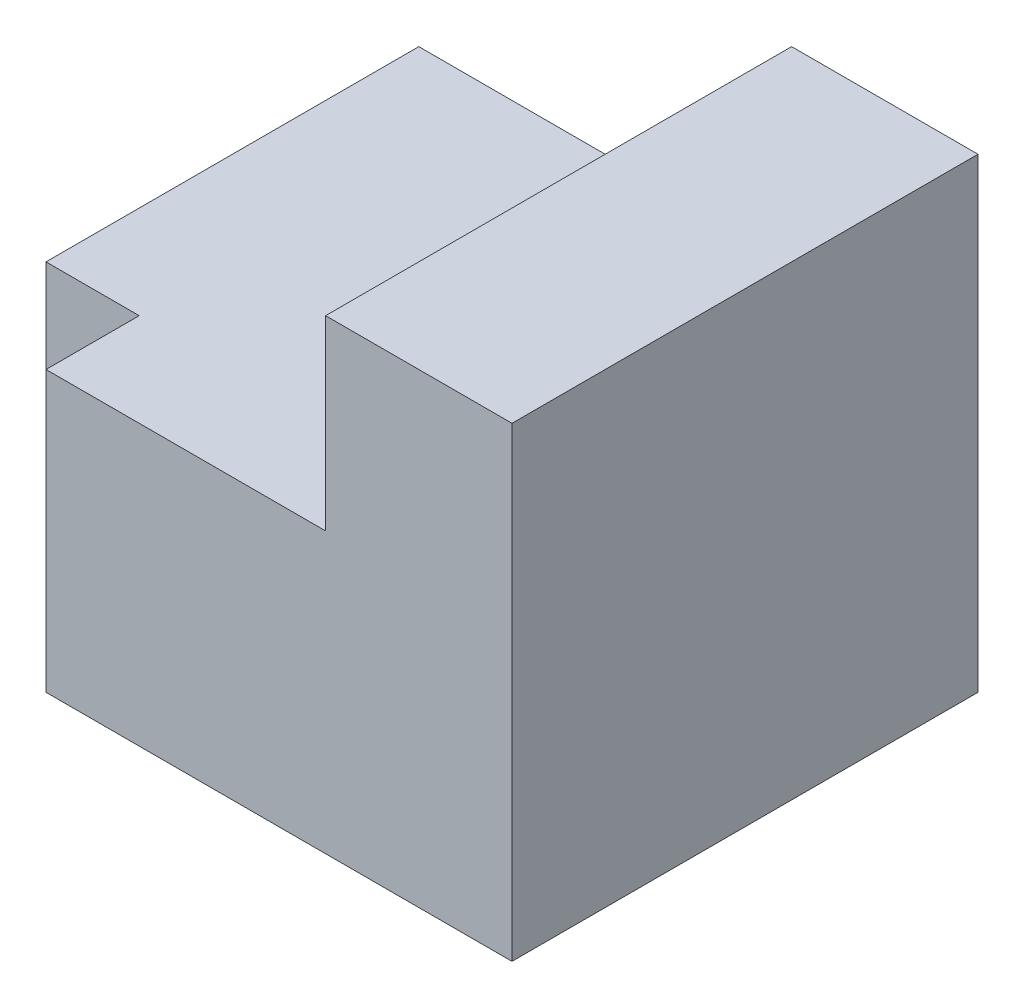
ISO-10303-21;
HEADER;
FILE_DESCRIPTION(('STEP AP214'),'2;1');
FILE_NAME('part.step','',(''),(''),'','','');
FILE_SCHEMA(('AUTOMOTIVE_DESIGN { 1 0 10303 214 1 1 1 1 }'));
ENDSEC;
DATA;
#1=APPLICATION_CONTEXT('core data for automotive mechanical design processes');
#2=APPLICATION_PROTOCOL_DEFINITION('international standard','automotive_design',2000,#1);
#3=PRODUCT_CONTEXT('',#1,'mechanical');
#4=PRODUCT('Part','Part','',(#3));
#5=PRODUCT_RELATED_PRODUCT_CATEGORY('part','',(#4));
#6=PRODUCT_DEFINITION_FORMATION('','',#4);
#7=PRODUCT_DEFINITION_CONTEXT('part definition',#1,'design');
#8=PRODUCT_DEFINITION('design','',#6,#7);
#9=PRODUCT_DEFINITION_SHAPE('','',#8);
#10=(LENGTH_UNIT() NAMED_UNIT(*) SI_UNIT(.MILLI.,.METRE.));
#11=(NAMED_UNIT(*) PLANE_ANGLE_UNIT() SI_UNIT($,.RADIAN.));
#12=(NAMED_UNIT(*) SI_UNIT($,.STERADIAN.) SOLID_ANGLE_UNIT());
#13=UNCERTAINTY_MEASURE_WITH_UNIT(LENGTH_MEASURE(1.E-05),#10,'distance_accuracy_value','');
#14=(GEOMETRIC_REPRESENTATION_CONTEXT(3) GLOBAL_UNCERTAINTY_ASSIGNED_CONTEXT((#13)) GLOBAL_UNIT_ASSIGNED_CONTEXT((#10,
#11,#12)) REPRESENTATION_CONTEXT('',''));
#15=CARTESIAN_POINT('',(0.,0.,0.));
#16=DIRECTION('',(0.,0.,1.));
#17=DIRECTION('',(1.,0.,0.));
#18=AXIS2_PLACEMENT_3D('',#15,#16,#17);
#19=CARTESIAN_POINT('',(0.,30.,50.));
#20=DIRECTION('',(0.,-1.,0.));
#21=DIRECTION('',(0.,0.,-1.));
#22=AXIS2_PLACEMENT_3D('',#19,#20,#21);
#23=PLANE('',#22);
#24=DIRECTION('',(1.,0.,0.));
#25=VECTOR('',#24,1.);
#26=CARTESIAN_POINT('',(20.,30.,30.));
#27=LINE('',#26,#25);
#28=CARTESIAN_POINT('',(20.,30.,30.));
#29=VERTEX_POINT('',#28);
#30=CARTESIAN_POINT('',(40.,30.,30.));
#31=VERTEX_POINT('',#30);
#32=EDGE_CURVE('E135',#29,#31,#27,.T.);
#33=ORIENTED_EDGE('',*,*,#32,.F.);
#34=DIRECTION('',(0.,0.,1.));
#35=VECTOR('',#34,1.);
#36=CARTESIAN_POINT('',(20.,30.,0.));
#37=LINE('',#36,#35);
#38=CARTESIAN_POINT('',(20.,30.,10.));
#39=VERTEX_POINT('',#38);
#40=EDGE_CURVE('E37',#39,#29,#37,.T.);
#41=ORIENTED_EDGE('',*,*,#40,.F.);
#42=DIRECTION('',(1.,0.,0.));
#43=VECTOR('',#42,1.);
#44=CARTESIAN_POINT('',(0.,30.,10.));
#45=LINE('',#44,#43);
#46=CARTESIAN_POINT('',(40.,30.,10.));
#47=VERTEX_POINT('',#46);
#48=EDGE_CURVE('E119',#39,#47,#45,.T.);
#49=ORIENTED_EDGE('',*,*,#48,.T.);
#50=DIRECTION('',(0.,0.,-1.));
#51=VECTOR('',#50,1.);
#52=CARTESIAN_POINT('',(40.,30.,10.));
#53=LINE('',#52,#51);
#54=CARTESIAN_POINT('',(40.,30.,0.));
#55=VERTEX_POINT('',#54);
#56=EDGE_CURVE('E196',#47,#55,#53,.T.);
#57=ORIENTED_EDGE('',*,*,#56,.T.);
#58=DIRECTION('',(-1.,0.,0.));
#59=VECTOR('',#58,1.);
#60=CARTESIAN_POINT('',(0.,30.,0.));
#61=LINE('',#60,#59);
#62=CARTESIAN_POINT('',(0.,30.,0.));
#63=VERTEX_POINT('',#62);
#64=EDGE_CURVE('E155',#55,#63,#61,.T.);
#65=ORIENTED_EDGE('',*,*,#64,.T.);
#66=DIRECTION('',(0.,0.,-1.));
#67=VECTOR('',#66,1.);
#68=CARTESIAN_POINT('',(0.,30.,50.));
#69=LINE('',#68,#67);
#70=CARTESIAN_POINT('',(0.,30.,40.));
#71=VERTEX_POINT('',#70);
#72=EDGE_CURVE('E162',#71,#63,#69,.T.);
#73=ORIENTED_EDGE('',*,*,#72,.F.);
#74=DIRECTION('',(-1.,0.,0.));
#75=VECTOR('',#74,1.);
#76=CARTESIAN_POINT('',(0.,30.,40.));
#77=LINE('',#76,#75);
#78=CARTESIAN_POINT('',(10.,30.,40.));
#79=VERTEX_POINT('',#78);
#80=EDGE_CURVE('E217',#79,#71,#77,.T.);
#81=ORIENTED_EDGE('',*,*,#80,.F.);
#82=DIRECTION('',(0.,0.,1.));
#83=VECTOR('',#82,1.);
#84=CARTESIAN_POINT('',(10.,30.,40.));
#85=LINE('',#84,#83);
#86=CARTESIAN_POINT('',(10.,30.,50.));
#87=VERTEX_POINT('',#86);
#88=EDGE_CURVE('E221',#79,#87,#85,.T.);
#89=ORIENTED_EDGE('',*,*,#88,.T.);
#90=DIRECTION('',(-1.,0.,0.));
#91=VECTOR('',#90,1.);
#92=CARTESIAN_POINT('',(0.,30.,50.));
#93=LINE('',#92,#91);
#94=CARTESIAN_POINT('',(40.,30.,50.));
#95=VERTEX_POINT('',#94);
#96=EDGE_CURVE('E157',#95,#87,#93,.T.);
#97=ORIENTED_EDGE('',*,*,#96,.F.);
#98=DIRECTION('',(0.,0.,1.));
#99=VECTOR('',#98,1.);
#100=CARTESIAN_POINT('',(40.,30.,20.));
#101=LINE('',#100,#99);
#102=EDGE_CURVE('E208',#31,#95,#101,.T.);
#103=ORIENTED_EDGE('',*,*,#102,.F.);
#104=EDGE_LOOP('',(#33,#41,#49,#57,#65,#73,#81,#89,#97,#103));
#105=FACE_BOUND('',#104,.T.);
#106=ADVANCED_FACE('F33',(#105),#23,.F.);
#107=CARTESIAN_POINT('',(40.,50.,0.));
#108=DIRECTION('',(-0.707106781186548,0.707106781186547,0.));
#109=DIRECTION('',(-0.707106781186547,-0.707106781186548,0.));
#110=AXIS2_PLACEMENT_3D('',#107,#108,#109);
#111=PLANE('',#110);
#112=DIRECTION('',(0.,0.,1.));
#113=VECTOR('',#112,1.);
#114=CARTESIAN_POINT('',(40.,50.,20.));
#115=LINE('',#114,#113);
#116=CARTESIAN_POINT('',(40.,50.,10.));
#117=VERTEX_POINT('',#116);
#118=CARTESIAN_POINT('',(40.,50.,30.));
#119=VERTEX_POINT('',#118);
#120=EDGE_CURVE('E132',#117,#119,#115,.T.);
#121=ORIENTED_EDGE('',*,*,#120,.F.);
#122=DIRECTION('',(0.707106781186547,0.707106781186548,0.));
#123=VECTOR('',#122,1.);
#124=CARTESIAN_POINT('',(-5.,4.99999999999999,10.));
#125=LINE('',#124,#123);
#126=EDGE_CURVE('E121',#39,#117,#125,.T.);
#127=ORIENTED_EDGE('',*,*,#126,.F.);
#128=ORIENTED_EDGE('',*,*,#40,.T.);
#129=DIRECTION('',(-0.707106781186547,-0.707106781186548,0.));
#130=VECTOR('',#129,1.);
#131=CARTESIAN_POINT('',(40.,50.,30.));
#132=LINE('',#131,#130);
#133=EDGE_CURVE('E350',#119,#29,#132,.T.);
#134=ORIENTED_EDGE('',*,*,#133,.F.);
#135=EDGE_LOOP('',(#121,#127,#128,#134));
#136=FACE_BOUND('',#135,.T.);
#137=ADVANCED_FACE('F130',(#136),#111,.T.);
#138=CARTESIAN_POINT('',(0.,0.,0.));
#139=DIRECTION('',(0.,0.,-1.));
#140=DIRECTION('',(-1.,0.,0.));
#141=AXIS2_PLACEMENT_3D('',#138,#139,#140);
#142=PLANE('',#141);
#143=ORIENTED_EDGE('',*,*,#64,.F.);
#144=DIRECTION('',(0.,-1.,0.));
#145=VECTOR('',#144,1.);
#146=CARTESIAN_POINT('',(40.,0.,0.));
#147=LINE('',#146,#145);
#148=CARTESIAN_POINT('',(40.,50.,0.));
#149=VERTEX_POINT('',#148);
#150=EDGE_CURVE('E128',#149,#55,#147,.T.);
#151=ORIENTED_EDGE('',*,*,#150,.F.);
#152=DIRECTION('',(-1.,0.,0.));
#153=VECTOR('',#152,1.);
#154=CARTESIAN_POINT('',(60.,50.,0.));
#155=LINE('',#154,#153);
#156=CARTESIAN_POINT('',(60.,50.,0.));
#157=VERTEX_POINT('',#156);
#158=EDGE_CURVE('E147',#157,#149,#155,.T.);
#159=ORIENTED_EDGE('',*,*,#158,.F.);
#160=DIRECTION('',(0.,1.,0.));
#161=VECTOR('',#160,1.);
#162=CARTESIAN_POINT('',(60.,0.,0.));
#163=LINE('',#162,#161);
#164=CARTESIAN_POINT('',(60.,0.,0.));
#165=VERTEX_POINT('',#164);
#166=EDGE_CURVE('E165',#165,#157,#163,.T.);
#167=ORIENTED_EDGE('',*,*,#166,.F.);
#168=DIRECTION('',(1.,0.,0.));
#169=VECTOR('',#168,1.);
#170=CARTESIAN_POINT('',(0.,0.,0.));
#171=LINE('',#170,#169);
#172=CARTESIAN_POINT('',(0.,0.,0.));
#173=VERTEX_POINT('',#172);
#174=EDGE_CURVE('E140',#173,#165,#171,.T.);
#175=ORIENTED_EDGE('',*,*,#174,.F.);
#176=DIRECTION('',(0.,-1.,0.));
#177=VECTOR('',#176,1.);
#178=CARTESIAN_POINT('',(0.,0.,0.));
#179=LINE('',#178,#177);
#180=EDGE_CURVE('E137',#63,#173,#179,.T.);
#181=ORIENTED_EDGE('',*,*,#180,.F.);
#182=EDGE_LOOP('',(#143,#151,#159,#167,#175,#181));
#183=FACE_BOUND('',#182,.T.);
#184=ADVANCED_FACE('F182',(#183),#142,.T.);
#185=CARTESIAN_POINT('',(0.,0.,50.));
#186=DIRECTION('',(0.,0.,-1.));
#187=DIRECTION('',(-1.,0.,0.));
#188=AXIS2_PLACEMENT_3D('',#185,#186,#187);
#189=PLANE('',#188);
#190=DIRECTION('',(0.,-1.,0.));
#191=VECTOR('',#190,1.);
#192=CARTESIAN_POINT('',(40.,0.,50.));
#193=LINE('',#192,#191);
#194=CARTESIAN_POINT('',(40.,50.,50.));
#195=VERTEX_POINT('',#194);
#196=EDGE_CURVE('E198',#195,#95,#193,.T.);
#197=ORIENTED_EDGE('',*,*,#196,.T.);
#198=ORIENTED_EDGE('',*,*,#96,.T.);
#199=DIRECTION('',(0.,1.,0.));
#200=VECTOR('',#199,1.);
#201=CARTESIAN_POINT('',(10.,30.,50.));
#202=LINE('',#201,#200);
#203=CARTESIAN_POINT('',(10.,0.,50.));
#204=VERTEX_POINT('',#203);
#205=EDGE_CURVE('E210',#204,#87,#202,.T.);
#206=ORIENTED_EDGE('',*,*,#205,.F.);
#207=DIRECTION('',(1.,0.,0.));
#208=VECTOR('',#207,1.);
#209=CARTESIAN_POINT('',(0.,0.,50.));
#210=LINE('',#209,#208);
#211=CARTESIAN_POINT('',(60.,0.,50.));
#212=VERTEX_POINT('',#211);
#213=EDGE_CURVE('E152',#204,#212,#210,.T.);
#214=ORIENTED_EDGE('',*,*,#213,.T.);
#215=DIRECTION('',(0.,1.,0.));
#216=VECTOR('',#215,1.);
#217=CARTESIAN_POINT('',(60.,0.,50.));
#218=LINE('',#217,#216);
#219=CARTESIAN_POINT('',(60.,50.,50.));
#220=VERTEX_POINT('',#219);
#221=EDGE_CURVE('E154',#212,#220,#218,.T.);
#222=ORIENTED_EDGE('',*,*,#221,.T.);
#223=DIRECTION('',(-1.,0.,0.));
#224=VECTOR('',#223,1.);
#225=CARTESIAN_POINT('',(60.,50.,50.));
#226=LINE('',#225,#224);
#227=EDGE_CURVE('E224',#220,#195,#226,.T.);
#228=ORIENTED_EDGE('',*,*,#227,.T.);
#229=EDGE_LOOP('',(#197,#198,#206,#214,#222,#228));
#230=FACE_BOUND('',#229,.T.);
#231=ADVANCED_FACE('F229',(#230),#189,.F.);
#232=CARTESIAN_POINT('',(0.,0.,50.));
#233=DIRECTION('',(1.,0.,0.));
#234=DIRECTION('',(0.,0.,-1.));
#235=AXIS2_PLACEMENT_3D('',#232,#233,#234);
#236=PLANE('',#235);
#237=DIRECTION('',(0.,-1.,0.));
#238=VECTOR('',#237,1.);
#239=CARTESIAN_POINT('',(0.,30.,40.));
#240=LINE('',#239,#238);
#241=CARTESIAN_POINT('',(0.,0.,40.));
#242=VERTEX_POINT('',#241);
#243=EDGE_CURVE('E193',#71,#242,#240,.T.);
#244=ORIENTED_EDGE('',*,*,#243,.F.);
#245=ORIENTED_EDGE('',*,*,#72,.T.);
#246=ORIENTED_EDGE('',*,*,#180,.T.);
#247=DIRECTION('',(0.,0.,-1.));
#248=VECTOR('',#247,1.);
#249=CARTESIAN_POINT('',(0.,0.,50.));
#250=LINE('',#249,#248);
#251=EDGE_CURVE('E11',#242,#173,#250,.T.);
#252=ORIENTED_EDGE('',*,*,#251,.F.);
#253=EDGE_LOOP('',(#244,#245,#246,#252));
#254=FACE_BOUND('',#253,.T.);
#255=ADVANCED_FACE('F35',(#254),#236,.F.);
#256=CARTESIAN_POINT('',(0.,0.,50.));
#257=DIRECTION('',(0.,1.,0.));
#258=DIRECTION('',(0.,0.,1.));
#259=AXIS2_PLACEMENT_3D('',#256,#257,#258);
#260=PLANE('',#259);
#261=ORIENTED_EDGE('',*,*,#213,.F.);
#262=DIRECTION('',(0.,0.,1.));
#263=VECTOR('',#262,1.);
#264=CARTESIAN_POINT('',(10.,0.,40.));
#265=LINE('',#264,#263);
#266=CARTESIAN_POINT('',(10.,0.,40.));
#267=VERTEX_POINT('',#266);
#268=EDGE_CURVE('E219',#267,#204,#265,.T.);
#269=ORIENTED_EDGE('',*,*,#268,.F.);
#270=DIRECTION('',(1.,0.,0.));
#271=VECTOR('',#270,1.);
#272=CARTESIAN_POINT('',(0.,0.,40.));
#273=LINE('',#272,#271);
#274=EDGE_CURVE('E190',#242,#267,#273,.T.);
#275=ORIENTED_EDGE('',*,*,#274,.F.);
#276=ORIENTED_EDGE('',*,*,#251,.T.);
#277=ORIENTED_EDGE('',*,*,#174,.T.);
#278=DIRECTION('',(0.,0.,-1.));
#279=VECTOR('',#278,1.);
#280=CARTESIAN_POINT('',(60.,0.,50.));
#281=LINE('',#280,#279);
#282=EDGE_CURVE('E43',#212,#165,#281,.T.);
#283=ORIENTED_EDGE('',*,*,#282,.F.);
#284=EDGE_LOOP('',(#261,#269,#275,#276,#277,#283));
#285=FACE_BOUND('',#284,.T.);
#286=ADVANCED_FACE('F185',(#285),#260,.F.);
#287=CARTESIAN_POINT('',(60.,0.,50.));
#288=DIRECTION('',(-1.,0.,0.));
#289=DIRECTION('',(0.,0.,1.));
#290=AXIS2_PLACEMENT_3D('',#287,#288,#289);
#291=PLANE('',#290);
#292=ORIENTED_EDGE('',*,*,#166,.T.);
#293=DIRECTION('',(0.,0.,1.));
#294=VECTOR('',#293,1.);
#295=CARTESIAN_POINT('',(60.,50.,0.));
#296=LINE('',#295,#294);
#297=EDGE_CURVE('E142',#157,#220,#296,.T.);
#298=ORIENTED_EDGE('',*,*,#297,.T.);
#299=ORIENTED_EDGE('',*,*,#221,.F.);
#300=ORIENTED_EDGE('',*,*,#282,.T.);
#301=EDGE_LOOP('',(#292,#298,#299,#300));
#302=FACE_BOUND('',#301,.T.);
#303=ADVANCED_FACE('F175',(#302),#291,.F.);
#304=CARTESIAN_POINT('',(60.,50.,0.));
#305=DIRECTION('',(0.,1.,0.));
#306=DIRECTION('',(0.,0.,1.));
#307=AXIS2_PLACEMENT_3D('',#304,#305,#306);
#308=PLANE('',#307);
#309=ORIENTED_EDGE('',*,*,#227,.F.);
#310=ORIENTED_EDGE('',*,*,#297,.F.);
#311=ORIENTED_EDGE('',*,*,#158,.T.);
#312=DIRECTION('',(0.,0.,1.));
#313=VECTOR('',#312,1.);
#314=CARTESIAN_POINT('',(40.,50.,0.));
#315=LINE('',#314,#313);
#316=EDGE_CURVE('E138',#149,#117,#315,.T.);
#317=ORIENTED_EDGE('',*,*,#316,.T.);
#318=ORIENTED_EDGE('',*,*,#120,.T.);
#319=EDGE_CURVE('E207',#119,#195,#115,.T.);
#320=ORIENTED_EDGE('',*,*,#319,.T.);
#321=EDGE_LOOP('',(#309,#310,#311,#317,#318,#320));
#322=FACE_BOUND('',#321,.T.);
#323=ADVANCED_FACE('F231',(#322),#308,.T.);
#324=CARTESIAN_POINT('',(10.,30.,40.));
#325=DIRECTION('',(1.,0.,0.));
#326=DIRECTION('',(0.,1.,0.));
#327=AXIS2_PLACEMENT_3D('',#324,#325,#326);
#328=PLANE('',#327);
#329=ORIENTED_EDGE('',*,*,#205,.T.);
#330=ORIENTED_EDGE('',*,*,#88,.F.);
#331=DIRECTION('',(0.,1.,0.));
#332=VECTOR('',#331,1.);
#333=CARTESIAN_POINT('',(10.,30.,40.));
#334=LINE('',#333,#332);
#335=EDGE_CURVE('E214',#267,#79,#334,.T.);
#336=ORIENTED_EDGE('',*,*,#335,.F.);
#337=ORIENTED_EDGE('',*,*,#268,.T.);
#338=EDGE_LOOP('',(#329,#330,#336,#337));
#339=FACE_BOUND('',#338,.T.);
#340=ADVANCED_FACE('F237',(#339),#328,.F.);
#341=CARTESIAN_POINT('',(0.,0.,40.));
#342=DIRECTION('',(0.,0.,1.));
#343=DIRECTION('',(1.,0.,0.));
#344=AXIS2_PLACEMENT_3D('',#341,#342,#343);
#345=PLANE('',#344);
#346=ORIENTED_EDGE('',*,*,#243,.T.);
#347=ORIENTED_EDGE('',*,*,#274,.T.);
#348=ORIENTED_EDGE('',*,*,#335,.T.);
#349=ORIENTED_EDGE('',*,*,#80,.T.);
#350=EDGE_LOOP('',(#346,#347,#348,#349));
#351=FACE_BOUND('',#350,.T.);
#352=ADVANCED_FACE('F239',(#351),#345,.T.);
#353=CARTESIAN_POINT('',(40.,0.,20.));
#354=DIRECTION('',(-1.,0.,0.));
#355=DIRECTION('',(0.,0.,1.));
#356=AXIS2_PLACEMENT_3D('',#353,#354,#355);
#357=PLANE('',#356);
#358=DIRECTION('',(0.,1.,0.));
#359=VECTOR('',#358,1.);
#360=CARTESIAN_POINT('',(40.,30.,30.));
#361=LINE('',#360,#359);
#362=EDGE_CURVE('E58',#31,#119,#361,.T.);
#363=ORIENTED_EDGE('',*,*,#362,.F.);
#364=ORIENTED_EDGE('',*,*,#102,.T.);
#365=ORIENTED_EDGE('',*,*,#196,.F.);
#366=ORIENTED_EDGE('',*,*,#319,.F.);
#367=EDGE_LOOP('',(#363,#364,#365,#366));
#368=FACE_BOUND('',#367,.T.);
#369=ADVANCED_FACE('F232',(#368),#357,.T.);
#370=CARTESIAN_POINT('',(40.,0.,10.));
#371=DIRECTION('',(1.,0.,0.));
#372=DIRECTION('',(0.,0.,-1.));
#373=AXIS2_PLACEMENT_3D('',#370,#371,#372);
#374=PLANE('',#373);
#375=ORIENTED_EDGE('',*,*,#150,.T.);
#376=ORIENTED_EDGE('',*,*,#56,.F.);
#377=DIRECTION('',(0.,-1.,0.));
#378=VECTOR('',#377,1.);
#379=CARTESIAN_POINT('',(40.,0.,10.));
#380=LINE('',#379,#378);
#381=EDGE_CURVE('E124',#117,#47,#380,.T.);
#382=ORIENTED_EDGE('',*,*,#381,.F.);
#383=ORIENTED_EDGE('',*,*,#316,.F.);
#384=EDGE_LOOP('',(#375,#376,#382,#383));
#385=FACE_BOUND('',#384,.T.);
#386=ADVANCED_FACE('F200',(#385),#374,.F.);
#387=CARTESIAN_POINT('',(0.,0.,10.));
#388=DIRECTION('',(0.,0.,-1.));
#389=DIRECTION('',(-1.,0.,0.));
#390=AXIS2_PLACEMENT_3D('',#387,#388,#389);
#391=PLANE('',#390);
#392=ORIENTED_EDGE('',*,*,#48,.F.);
#393=ORIENTED_EDGE('',*,*,#126,.T.);
#394=ORIENTED_EDGE('',*,*,#381,.T.);
#395=EDGE_LOOP('',(#392,#393,#394));
#396=FACE_BOUND('',#395,.T.);
#397=ADVANCED_FACE('F120',(#396),#391,.T.);
#398=CARTESIAN_POINT('',(0.,0.,30.));
#399=DIRECTION('',(0.,0.,1.));
#400=DIRECTION('',(1.,0.,0.));
#401=AXIS2_PLACEMENT_3D('',#398,#399,#400);
#402=PLANE('',#401);
#403=ORIENTED_EDGE('',*,*,#133,.T.);
#404=ORIENTED_EDGE('',*,*,#32,.T.);
#405=ORIENTED_EDGE('',*,*,#362,.T.);
#406=EDGE_LOOP('',(#403,#404,#405));
#407=FACE_BOUND('',#406,.T.);
#408=ADVANCED_FACE('F317',(#407),#402,.T.);
#409=CLOSED_SHELL('',(#106,#137,#184,#231,#255,#286,#303,#323,#340,#352,#369,#386,#397,#408));
#410=MANIFOLD_SOLID_BREP('B2',#409);
#411=ADVANCED_BREP_SHAPE_REPRESENTATION('',(#18,#410),#14);
#412=SHAPE_DEFINITION_REPRESENTATION(#9,#411);
ENDSEC;
END-ISO-10303-21;
